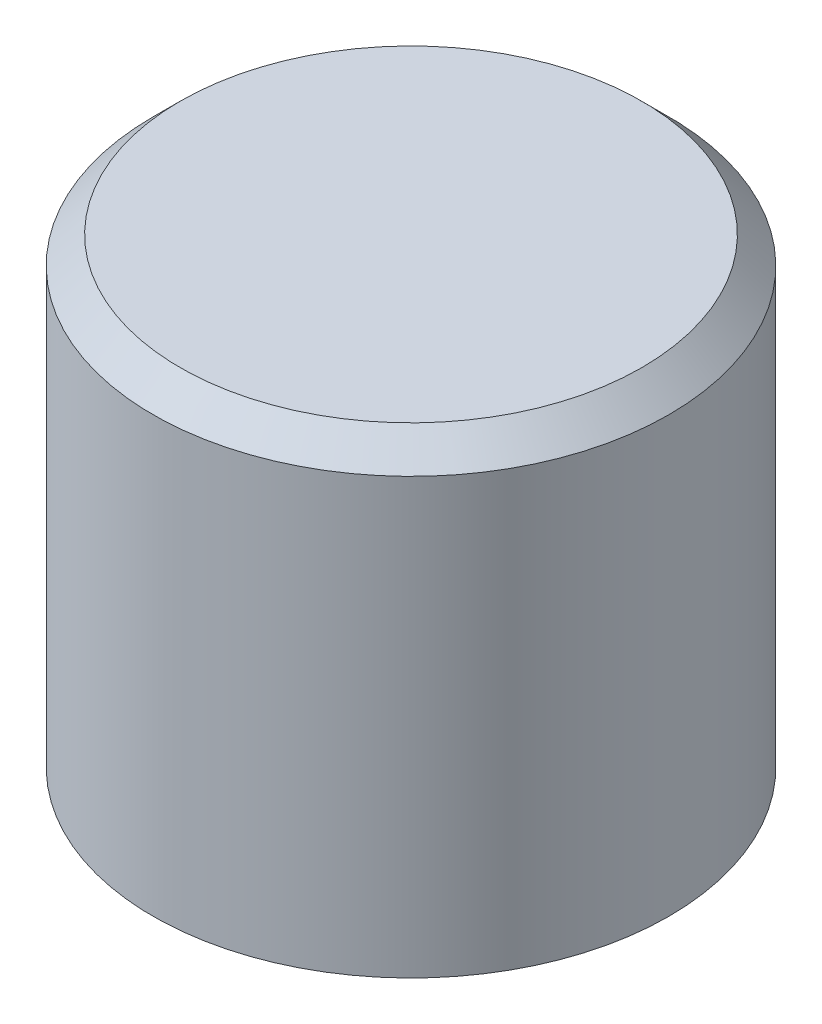
ISO-10303-21;
HEADER;
FILE_DESCRIPTION(('STEP AP214'),'2;1');
FILE_NAME('part.step','',(''),(''),'','','');
FILE_SCHEMA(('AUTOMOTIVE_DESIGN { 1 0 10303 214 1 1 1 1 }'));
ENDSEC;
DATA;
#1=APPLICATION_CONTEXT('core data for automotive mechanical design processes');
#2=APPLICATION_PROTOCOL_DEFINITION('international standard','automotive_design',2000,#1);
#3=PRODUCT_CONTEXT('',#1,'mechanical');
#4=PRODUCT('Part','Part','',(#3));
#5=PRODUCT_RELATED_PRODUCT_CATEGORY('part','',(#4));
#6=PRODUCT_DEFINITION_FORMATION('','',#4);
#7=PRODUCT_DEFINITION_CONTEXT('part definition',#1,'design');
#8=PRODUCT_DEFINITION('design','',#6,#7);
#9=PRODUCT_DEFINITION_SHAPE('','',#8);
#10=(LENGTH_UNIT() NAMED_UNIT(*) SI_UNIT(.MILLI.,.METRE.));
#11=(NAMED_UNIT(*) PLANE_ANGLE_UNIT() SI_UNIT($,.RADIAN.));
#12=(NAMED_UNIT(*) SI_UNIT($,.STERADIAN.) SOLID_ANGLE_UNIT());
#13=UNCERTAINTY_MEASURE_WITH_UNIT(LENGTH_MEASURE(1.E-05),#10,'distance_accuracy_value','');
#14=(GEOMETRIC_REPRESENTATION_CONTEXT(3) GLOBAL_UNCERTAINTY_ASSIGNED_CONTEXT((#13)) GLOBAL_UNIT_ASSIGNED_CONTEXT((#10,
#11,#12)) REPRESENTATION_CONTEXT('',''));
#15=CARTESIAN_POINT('',(0.,0.,0.));
#16=DIRECTION('',(0.,0.,1.));
#17=DIRECTION('',(1.,0.,0.));
#18=AXIS2_PLACEMENT_3D('',#15,#16,#17);
#19=CARTESIAN_POINT('',(0.,8.5,0.));
#20=DIRECTION('',(0.,-1.,0.));
#21=DIRECTION('',(1.,0.,0.));
#22=AXIS2_PLACEMENT_3D('',#19,#20,#21);
#23=PLANE('',#22);
#24=CARTESIAN_POINT('',(0.,8.5,0.));
#25=DIRECTION('',(0.,1.,0.));
#26=DIRECTION('',(-1.,0.,0.));
#27=AXIS2_PLACEMENT_3D('',#24,#25,#26);
#28=CIRCLE('',#27,8.5);
#29=CARTESIAN_POINT('',(-8.50000000000001,8.49999999999999,0.));
#30=VERTEX_POINT('',#29);
#31=EDGE_CURVE('E11',#30,#30,#28,.T.);
#32=ORIENTED_EDGE('',*,*,#31,.T.);
#33=EDGE_LOOP('',(#32));
#34=FACE_BOUND('',#33,.T.);
#35=ADVANCED_FACE('F36',(#34),#23,.F.);
#36=CARTESIAN_POINT('',(0.,7.5,0.));
#37=DIRECTION('',(0.,-1.,0.));
#38=DIRECTION('',(1.,0.,0.));
#39=AXIS2_PLACEMENT_3D('',#36,#37,#38);
#40=CONICAL_SURFACE('',#39,9.5,0.785398163397448);
#41=ORIENTED_EDGE('',*,*,#31,.F.);
#42=EDGE_LOOP('',(#41));
#43=FACE_BOUND('',#42,.T.);
#44=CARTESIAN_POINT('',(0.,7.5,0.));
#45=DIRECTION('',(0.,1.,0.));
#46=DIRECTION('',(-1.,0.,0.));
#47=AXIS2_PLACEMENT_3D('',#44,#45,#46);
#48=CIRCLE('',#47,9.50000000000001);
#49=CARTESIAN_POINT('',(-9.50000000000001,7.5,0.));
#50=VERTEX_POINT('',#49);
#51=EDGE_CURVE('E48',#50,#50,#48,.T.);
#52=ORIENTED_EDGE('',*,*,#51,.T.);
#53=EDGE_LOOP('',(#52));
#54=FACE_BOUND('',#53,.T.);
#55=ADVANCED_FACE('F108',(#43,#54),#40,.T.);
#56=CARTESIAN_POINT('',(0.,8.5,0.));
#57=DIRECTION('',(0.,1.,0.));
#58=DIRECTION('',(-1.,0.,0.));
#59=AXIS2_PLACEMENT_3D('',#56,#57,#58);
#60=CYLINDRICAL_SURFACE('',#59,9.5);
#61=CARTESIAN_POINT('',(1.1303,2.5,-9.43251938296445));
#62=CARTESIAN_POINT('',(1.13029729673654,2.43675209899943,-9.43252025267097));
#63=CARTESIAN_POINT('',(1.12497337602373,2.37346406905431,-9.43316239302475));
#64=CARTESIAN_POINT('',(1.10381839885863,2.24864759113215,-9.43566076196922));
#65=CARTESIAN_POINT('',(1.08797620633137,2.1871210802331,-9.43751827729107));
#66=CARTESIAN_POINT('',(1.04625682246219,2.06765295240496,-9.44223408820014));
#67=CARTESIAN_POINT('',(1.02038625194472,2.00970899944382,-9.44509172337866));
#68=CARTESIAN_POINT('',(0.959358297665038,1.89899641241189,-9.45148499094721));
#69=CARTESIAN_POINT('',(0.924202568260509,1.84622685870116,-9.45502050252777));
#70=CARTESIAN_POINT('',(0.84541065814901,1.74708146620531,-9.46239129242311));
#71=CARTESIAN_POINT('',(0.801736725239775,1.70073572197759,-9.46622785800506));
#72=CARTESIAN_POINT('',(0.707229305333533,1.61601329299469,-9.4737568706389));
#73=CARTESIAN_POINT('',(0.656395469993588,1.57763699619327,-9.47744931066765));
#74=CARTESIAN_POINT('',(0.548823128538747,1.50983574280943,-9.48428711110801));
#75=CARTESIAN_POINT('',(0.492067424631725,1.48043788937346,-9.48743080301658));
#76=CARTESIAN_POINT('',(0.374381126149074,1.43160155810803,-9.49280278116101));
#77=CARTESIAN_POINT('',(0.313450672666535,1.41216274388315,-9.4950310983158));
#78=CARTESIAN_POINT('',(0.189451505363669,1.38388583852823,-9.49831219623447));
#79=CARTESIAN_POINT('',(0.126394322261157,1.37499783547345,-9.49937051019601));
#80=CARTESIAN_POINT('',(-0.000324891536321905,1.36792023011297,-9.5002112351669));
#81=CARTESIAN_POINT('',(-0.0639869004674927,1.36973024429917,-9.49999369191384));
#82=CARTESIAN_POINT('',(-0.189769249176353,1.38395716021668,-9.49831170361627));
#83=CARTESIAN_POINT('',(-0.251895756367292,1.39632038566214,-9.49685356865555));
#84=CARTESIAN_POINT('',(-0.373185838498062,1.43121894501187,-9.49286135812316));
#85=CARTESIAN_POINT('',(-0.432349361612799,1.45375445676905,-9.4903272637394));
#86=CARTESIAN_POINT('',(-0.546201001842327,1.50841542991829,-9.48445703605298));
#87=CARTESIAN_POINT('',(-0.600877796589479,1.54056425637857,-9.48111895255263));
#88=CARTESIAN_POINT('',(-0.704080386813695,1.61352228422025,-9.47401449834974));
#89=CARTESIAN_POINT('',(-0.75260592651891,1.6543318455302,-9.47024810985042));
#90=CARTESIAN_POINT('',(-0.842443645401088,1.74375387032641,-9.46268132531405));
#91=CARTESIAN_POINT('',(-0.883709291599561,1.79241309156265,-9.45888086312078));
#92=CARTESIAN_POINT('',(-0.957494554378539,1.89599217012994,-9.45169735122941));
#93=CARTESIAN_POINT('',(-0.990014147980316,1.95091204390923,-9.448314302628));
#94=CARTESIAN_POINT('',(-1.04538609819267,2.06549342670439,-9.44234862488318));
#95=CARTESIAN_POINT('',(-1.06823495026205,2.12515664535429,-9.43976628599624));
#96=CARTESIAN_POINT('',(-1.10357672108818,2.24751056877989,-9.43570017369646));
#97=CARTESIAN_POINT('',(-1.11607009053464,2.31020114167387,-9.43421635247441));
#98=CARTESIAN_POINT('',(-1.1302850922461,2.43641988715194,-9.43252391667471));
#99=CARTESIAN_POINT('',(-1.13207210966562,2.49994059615691,-9.4323075616881));
#100=CARTESIAN_POINT('',(-1.12499599116383,2.62637626029155,-9.43315409702457));
#101=CARTESIAN_POINT('',(-1.11613306041061,2.68929122706713,-9.43421696270384));
#102=CARTESIAN_POINT('',(-1.08806359469444,2.81253493881977,-9.43749512502887));
#103=CARTESIAN_POINT('',(-1.0688885260964,2.87287095173617,-9.43970691516055));
#104=CARTESIAN_POINT('',(-1.02077141510833,2.98947102807533,-9.4450308731963));
#105=CARTESIAN_POINT('',(-0.991829060265779,3.04573496116355,-9.44814306990364));
#106=CARTESIAN_POINT('',(-0.924837392396674,3.15289015149911,-9.45493577176373));
#107=CARTESIAN_POINT('',(-0.886745083763212,3.20375435770687,-9.45861892998419));
#108=CARTESIAN_POINT('',(-0.802595807924174,3.29839067912928,-9.46613013979121));
#109=CARTESIAN_POINT('',(-0.756538560542182,3.34216254475726,-9.46995819647104));
#110=CARTESIAN_POINT('',(-0.657481685387736,3.42160025323289,-9.47735155346942));
#111=CARTESIAN_POINT('',(-0.604447543020714,3.45722321176042,-9.48091539986245));
#112=CARTESIAN_POINT('',(-0.493110851153499,3.51905559736204,-9.48735720395843));
#113=CARTESIAN_POINT('',(-0.434808399241305,3.54526519876057,-9.49023517436267));
#114=CARTESIAN_POINT('',(-0.314734451794647,3.5874555752365,-9.49497447819186));
#115=CARTESIAN_POINT('',(-0.252971868918825,3.60346142449211,-9.49683830206303));
#116=CARTESIAN_POINT('',(-0.127612324302294,3.62487159189028,-9.49934962268275));
#117=CARTESIAN_POINT('',(-0.0640154372253324,3.63027634092514,-9.49999716886808));
#118=CARTESIAN_POINT('',(0.062788065783669,3.63032335937165,-9.50000279537353));
#119=CARTESIAN_POINT('',(0.125994667091033,3.62503186909515,-9.49936881202669));
#120=CARTESIAN_POINT('',(0.250613675982355,3.60397654630575,-9.49689835171094));
#121=CARTESIAN_POINT('',(0.312026084028317,3.5882127164895,-9.4950618750517));
#122=CARTESIAN_POINT('',(0.43130684317044,3.54668037674206,-9.49039192931731));
#123=CARTESIAN_POINT('',(0.48917620164435,3.52091472601644,-9.48755874519112));
#124=CARTESIAN_POINT('',(0.599780011912009,3.4601170064304,-9.4812096483223));
#125=CARTESIAN_POINT('',(0.652514426051388,3.42508486962616,-9.47769373057379));
#126=CARTESIAN_POINT('',(0.75169020716829,3.34650251162856,-9.47034599616089));
#127=CARTESIAN_POINT('',(0.798092358276887,3.30290295892214,-9.46651242812114));
#128=CARTESIAN_POINT('',(0.882948322582621,3.20852503780183,-9.458975735517));
#129=CARTESIAN_POINT('',(0.92140024488168,3.15774496638415,-9.45527264215831));
#130=CARTESIAN_POINT('',(0.989377750142138,3.05024504723991,-9.4484023311034));
#131=CARTESIAN_POINT('',(1.01887155732429,2.99350499436638,-9.44523703815676));
#132=CARTESIAN_POINT('',(1.06787108902271,2.87587265791908,-9.43982333105209));
#133=CARTESIAN_POINT('',(1.08738778225179,2.8149850180016,-9.43757391055185));
#134=CARTESIAN_POINT('',(1.11115551492696,2.71147848297237,-9.43479836143403));
#135=CARTESIAN_POINT('',(1.11832450861114,2.66951496066416,-9.43394794398313));
#136=CARTESIAN_POINT('',(1.12789764424011,2.58504033792679,-9.43280816420104));
#137=CARTESIAN_POINT('',(1.13030181773216,2.54252924112492,-9.43251879815519));
#138=CARTESIAN_POINT('',(1.1303,2.5,-9.43251938296445));
#139=B_SPLINE_CURVE_WITH_KNOTS('',3,(#61,#62,#63,#64,#65,#66,#67,#68,#69,#70,#71,#72,#73,#74,
#75,#76,#77,#78,#79,#80,#81,#82,#83,#84,#85,#86,#87,#88,#89,#90,#91,#92,#93,#94,#95,#96,#97,#98,
#99,#100,#101,#102,#103,#104,#105,#106,#107,#108,#109,#110,#111,#112,#113,#114,#115,#116,#117,
#118,#119,#120,#121,#122,#123,#124,#125,#126,#127,#128,#129,#130,#131,#132,#133,#134,#135,#136,
#137,#138),.UNSPECIFIED.,.T.,.F.,(4,2,2,2,2,2,2,2,2,2,2,2,2,2,2,2,2,2,2,2,2,2,2,2,2,2,2,2,2,2,2,
2,2,2,2,2,2,2,4),(0.,0.189588352140623,0.379377749093088,0.569042058219121,0.758672597197918,
0.949163491168442,1.13966365608834,1.33073332419121,1.52179653793688,1.7119522550108,
1.90210115532477,2.09128863429427,2.28047942115772,2.47013382446012,2.65979611108984,
2.85063296472298,3.04147031974174,3.23237677245364,3.42327491612799,3.6130060205851,
3.80273346998724,3.99188524461076,4.1810430707159,4.3711077626118,4.56117914162504,
4.75222888541498,4.94327509100321,5.13385000115804,5.32441716504493,5.51380778895664,
5.70319836409987,5.89253483826645,6.08187270072637,6.27233453255905,6.46284161223051,
6.65401676263276,6.84498128304084,6.97246538923302,7.09994865136674),.UNSPECIFIED.);
#140=CARTESIAN_POINT('',(1.1303,2.5,-9.43251938296445));
#141=VERTEX_POINT('',#140);
#142=EDGE_CURVE('E72',#141,#141,#139,.T.);
#143=ORIENTED_EDGE('',*,*,#142,.F.);
#144=EDGE_LOOP('',(#143));
#145=FACE_BOUND('',#144,.T.);
#146=ORIENTED_EDGE('',*,*,#51,.F.);
#147=EDGE_LOOP('',(#146));
#148=FACE_BOUND('',#147,.T.);
#149=CARTESIAN_POINT('',(0.,-8.5,0.));
#150=DIRECTION('',(0.,1.,0.));
#151=DIRECTION('',(-1.,0.,0.));
#152=AXIS2_PLACEMENT_3D('',#149,#150,#151);
#153=CIRCLE('',#152,9.5);
#154=CARTESIAN_POINT('',(-9.5,-8.50000000000001,0.));
#155=VERTEX_POINT('',#154);
#156=EDGE_CURVE('E52',#155,#155,#153,.T.);
#157=ORIENTED_EDGE('',*,*,#156,.T.);
#158=EDGE_LOOP('',(#157));
#159=FACE_BOUND('',#158,.T.);
#160=ADVANCED_FACE('F105',(#145,#148,#159),#60,.T.);
#161=CARTESIAN_POINT('',(9.5,-8.5,0.));
#162=DIRECTION('',(0.,1.,0.));
#163=DIRECTION('',(-1.,0.,0.));
#164=AXIS2_PLACEMENT_3D('',#161,#162,#163);
#165=PLANE('',#164);
#166=ORIENTED_EDGE('',*,*,#156,.F.);
#167=EDGE_LOOP('',(#166));
#168=FACE_BOUND('',#167,.T.);
#169=CARTESIAN_POINT('',(0.,-8.5,0.));
#170=DIRECTION('',(0.,1.,0.));
#171=DIRECTION('',(-1.,0.,0.));
#172=AXIS2_PLACEMENT_3D('',#169,#170,#171);
#173=CIRCLE('',#172,8.5);
#174=CARTESIAN_POINT('',(-8.5,-8.50000000000001,0.));
#175=VERTEX_POINT('',#174);
#176=EDGE_CURVE('E57',#175,#175,#173,.T.);
#177=ORIENTED_EDGE('',*,*,#176,.T.);
#178=EDGE_LOOP('',(#177));
#179=FACE_BOUND('',#178,.T.);
#180=ADVANCED_FACE('F101',(#168,#179),#165,.F.);
#181=CARTESIAN_POINT('',(0.,8.5,0.));
#182=DIRECTION('',(0.,1.,0.));
#183=DIRECTION('',(-1.,0.,0.));
#184=AXIS2_PLACEMENT_3D('',#181,#182,#183);
#185=CYLINDRICAL_SURFACE('',#184,8.5);
#186=ORIENTED_EDGE('',*,*,#176,.F.);
#187=EDGE_LOOP('',(#186));
#188=FACE_BOUND('',#187,.T.);
#189=CARTESIAN_POINT('',(0.,-3.5,0.));
#190=DIRECTION('',(0.,1.,0.));
#191=DIRECTION('',(-1.,0.,0.));
#192=AXIS2_PLACEMENT_3D('',#189,#190,#191);
#193=CIRCLE('',#192,8.5);
#194=CARTESIAN_POINT('',(-8.5,-3.50000000000001,0.));
#195=VERTEX_POINT('',#194);
#196=EDGE_CURVE('E60',#195,#195,#193,.T.);
#197=ORIENTED_EDGE('',*,*,#196,.T.);
#198=EDGE_LOOP('',(#197));
#199=FACE_BOUND('',#198,.T.);
#200=ADVANCED_FACE('F97',(#188,#199),#185,.F.);
#201=CARTESIAN_POINT('',(0.,-0.500000000000002,0.));
#202=DIRECTION('',(0.,-1.,0.));
#203=DIRECTION('',(1.,0.,0.));
#204=AXIS2_PLACEMENT_3D('',#201,#202,#203);
#205=CONICAL_SURFACE('',#204,5.5,0.785398163397448);
#206=ORIENTED_EDGE('',*,*,#196,.F.);
#207=EDGE_LOOP('',(#206));
#208=FACE_BOUND('',#207,.T.);
#209=CARTESIAN_POINT('',(0.,-0.500000000000002,0.));
#210=DIRECTION('',(0.,1.,0.));
#211=DIRECTION('',(-1.,0.,0.));
#212=AXIS2_PLACEMENT_3D('',#209,#210,#211);
#213=CIRCLE('',#212,5.5);
#214=CARTESIAN_POINT('',(-5.5,-0.500000000000004,0.));
#215=VERTEX_POINT('',#214);
#216=EDGE_CURVE('E63',#215,#215,#213,.T.);
#217=ORIENTED_EDGE('',*,*,#216,.T.);
#218=EDGE_LOOP('',(#217));
#219=FACE_BOUND('',#218,.T.);
#220=ADVANCED_FACE('F93',(#208,#219),#205,.F.);
#221=CARTESIAN_POINT('',(5.5,-0.499999999999999,0.));
#222=DIRECTION('',(0.,1.,0.));
#223=DIRECTION('',(-1.,0.,0.));
#224=AXIS2_PLACEMENT_3D('',#221,#222,#223);
#225=PLANE('',#224);
#226=CARTESIAN_POINT('',(0.,-0.500000000000001,0.));
#227=DIRECTION('',(0.,-1.,0.));
#228=DIRECTION('',(1.,0.,0.));
#229=AXIS2_PLACEMENT_3D('',#226,#227,#228);
#230=CIRCLE('',#229,3.175);
#231=CARTESIAN_POINT('',(3.175,-0.5,0.));
#232=VERTEX_POINT('',#231);
#233=EDGE_CURVE('E69',#232,#232,#230,.T.);
#234=ORIENTED_EDGE('',*,*,#233,.F.);
#235=EDGE_LOOP('',(#234));
#236=FACE_BOUND('',#235,.T.);
#237=ORIENTED_EDGE('',*,*,#216,.F.);
#238=EDGE_LOOP('',(#237));
#239=FACE_BOUND('',#238,.T.);
#240=ADVANCED_FACE('F89',(#236,#239),#225,.F.);
#241=CARTESIAN_POINT('',(0.,17.4802561210692,0.));
#242=DIRECTION('',(0.,-1.,0.));
#243=DIRECTION('',(1.,0.,0.));
#244=AXIS2_PLACEMENT_3D('',#241,#242,#243);
#245=CYLINDRICAL_SURFACE('',#244,3.175);
#246=CARTESIAN_POINT('',(1.1303,2.5,-2.96699290696827));
#247=CARTESIAN_POINT('',(1.13030126949561,2.43871104066149,-2.96699180092178));
#248=CARTESIAN_POINT('',(1.12529831217773,2.37743087265426,-2.96891266523162));
#249=CARTESIAN_POINT('',(1.10549852105486,2.2567032380783,-2.976341367105));
#250=CARTESIAN_POINT('',(1.09070115134954,2.19725587197743,-2.9818494009399));
#251=CARTESIAN_POINT('',(1.05191211633808,2.08196624751789,-2.99575115501929));
#252=CARTESIAN_POINT('',(1.02794056093624,2.02611641398142,-3.00413855954278));
#253=CARTESIAN_POINT('',(0.971553767874789,1.91921075037205,-3.02284430324832));
#254=CARTESIAN_POINT('',(0.939136285382001,1.86815619974747,-3.03316315558202));
#255=CARTESIAN_POINT('',(0.865225378101704,1.77000779314337,-3.05508626986901));
#256=CARTESIAN_POINT('',(0.823416737479138,1.72315910938416,-3.06672572194972));
#257=CARTESIAN_POINT('',(0.732580946565029,1.63696785663703,-3.08968323184445));
#258=CARTESIAN_POINT('',(0.683552447130751,1.59762669370735,-3.1010012291171));
#259=CARTESIAN_POINT('',(0.577839731348625,1.52641872000411,-3.1224537652803));
#260=CARTESIAN_POINT('',(0.520968849300918,1.49481389119784,-3.13254217002369));
#261=CARTESIAN_POINT('',(0.402295832054575,1.44171944070599,-3.14997980235623));
#262=CARTESIAN_POINT('',(0.340495233260628,1.42022668176793,-3.15732987935941));
#263=CARTESIAN_POINT('',(0.216291429363959,1.38881290011866,-3.16821317131574));
#264=CARTESIAN_POINT('',(0.154007098319547,1.37847077218956,-3.17188488321263));
#265=CARTESIAN_POINT('',(0.0284859904407207,1.36830739361332,-3.1754922345549));
#266=CARTESIAN_POINT('',(-0.0347505016117886,1.36848305732182,-3.17542896974461));
#267=CARTESIAN_POINT('',(-0.157380355815446,1.37909474254008,-3.17166431166137));
#268=CARTESIAN_POINT('',(-0.216819232200467,1.38907222153224,-3.16812551082658));
#269=CARTESIAN_POINT('',(-0.333116055100486,1.41823912297426,-3.15801637664471));
#270=CARTESIAN_POINT('',(-0.389973821301095,1.4374291879277,-3.15144583185916));
#271=CARTESIAN_POINT('',(-0.500434290449896,1.48471458900652,-3.13581701279072));
#272=CARTESIAN_POINT('',(-0.553980350398553,1.5129307133355,-3.12672523235359));
#273=CARTESIAN_POINT('',(-0.655704901634495,1.57736408624447,-3.10698647045265));
#274=CARTESIAN_POINT('',(-0.703881757104614,1.61358376326904,-3.09633901729824));
#275=CARTESIAN_POINT('',(-0.796215706775618,1.69525388606659,-3.07392952110035));
#276=CARTESIAN_POINT('',(-0.840022503287889,1.74109295380745,-3.06213831691244));
#277=CARTESIAN_POINT('',(-0.919450536225369,1.83955262127153,-3.03923485845035));
#278=CARTESIAN_POINT('',(-0.955070114455716,1.89217459140461,-3.02812274204891));
#279=CARTESIAN_POINT('',(-1.01769271316585,2.00395927014954,-3.00766281876103));
#280=CARTESIAN_POINT('',(-1.04452651167638,2.06322387032357,-2.99835093480064));
#281=CARTESIAN_POINT('',(-1.08770687791103,2.18584794602894,-2.98296002370199));
#282=CARTESIAN_POINT('',(-1.10405859416822,2.24920539439739,-2.97687940969725));
#283=CARTESIAN_POINT('',(-1.12505332850273,2.37478496139067,-2.96900658684162));
#284=CARTESIAN_POINT('',(-1.13024679297079,2.43690238719621,-2.96701300712206));
#285=CARTESIAN_POINT('',(-1.13035235934412,2.5611397141368,-2.96697312971029));
#286=CARTESIAN_POINT('',(-1.12526668272106,2.62325961183634,-2.9689259791374));
#287=CARTESIAN_POINT('',(-1.10545550475944,2.74306963694744,-2.97635611028255));
#288=CARTESIAN_POINT('',(-1.0911347174114,2.80083689931116,-2.98168526601896));
#289=CARTESIAN_POINT('',(-1.05375787852425,2.91312956528054,-2.99509779472348));
#290=CARTESIAN_POINT('',(-1.03070014678855,2.96765434299104,-3.00318169742523));
#291=CARTESIAN_POINT('',(-0.975593219400547,3.07402870077888,-3.0215413409512));
#292=CARTESIAN_POINT('',(-0.943258091531735,3.12571831619922,-3.03188377797999));
#293=CARTESIAN_POINT('',(-0.870827536052561,3.22313515891388,-3.0534751542732));
#294=CARTESIAN_POINT('',(-0.830729519593916,3.26886038860491,-3.0647243952155));
#295=CARTESIAN_POINT('',(-0.741245393025423,3.35570682630943,-3.0876248127599));
#296=CARTESIAN_POINT('',(-0.691464443347563,3.39642589385312,-3.09926313882806));
#297=CARTESIAN_POINT('',(-0.585488794794463,3.4689702537958,-3.12101743586169));
#298=CARTESIAN_POINT('',(-0.529294210180944,3.50079570460365,-3.13113343394065));
#299=CARTESIAN_POINT('',(-0.412253306959744,3.55439303737067,-3.14867455762266));
#300=CARTESIAN_POINT('',(-0.351432796366107,3.57621652202379,-3.15611345134428));
#301=CARTESIAN_POINT('',(-0.226662836118679,3.60921657077384,-3.16751726579441));
#302=CARTESIAN_POINT('',(-0.162714706431159,3.62039758629356,-3.17148363891749));
#303=CARTESIAN_POINT('',(-0.0371588940228263,3.63135162680515,-3.17537085125336));
#304=CARTESIAN_POINT('',(0.0243929105435869,3.63169853870223,-3.17549520012136));
#305=CARTESIAN_POINT('',(0.146637730412363,3.62242232763044,-3.1722011158763));
#306=CARTESIAN_POINT('',(0.207330832009701,3.61280021381262,-3.16878304135799));
#307=CARTESIAN_POINT('',(0.324899902225857,3.58425332312023,-3.1588730580352));
#308=CARTESIAN_POINT('',(0.381828226370772,3.56552049032344,-3.15244466988758));
#309=CARTESIAN_POINT('',(0.491747356923696,3.51946825328886,-3.13717898355161));
#310=CARTESIAN_POINT('',(0.544737424039252,3.49214724188061,-3.12834123452256));
#311=CARTESIAN_POINT('',(0.647587160628671,3.4284464342489,-3.10871467602532));
#312=CARTESIAN_POINT('',(0.69723748981861,3.39174861614924,-3.09786207604759));
#313=CARTESIAN_POINT('',(0.789857808823599,3.31085525273558,-3.07555250387425));
#314=CARTESIAN_POINT('',(0.832825512939461,3.26665715281576,-3.06409532667805));
#315=CARTESIAN_POINT('',(0.912898108309838,3.16957728604716,-3.04122635424545));
#316=CARTESIAN_POINT('',(0.949639270596971,3.11638813255844,-3.0298412400875));
#317=CARTESIAN_POINT('',(1.01365584279662,3.00422984781983,-3.00903053343651));
#318=CARTESIAN_POINT('',(1.04093198735494,2.94526116561516,-2.99960478888595));
#319=CARTESIAN_POINT('',(1.08510912643682,2.82302364224739,-2.9839099977344));
#320=CARTESIAN_POINT('',(1.10199264087853,2.75974775389295,-2.97764627271748));
#321=CARTESIAN_POINT('',(1.12458464442987,2.63097715823261,-2.96918932171508));
#322=CARTESIAN_POINT('',(1.13029864362041,2.56548356118473,-2.96699408871232));
#323=CARTESIAN_POINT('',(1.1303,2.5,-2.96699290696827));
#324=B_SPLINE_CURVE_WITH_KNOTS('',3,(#246,#247,#248,#249,#250,#251,#252,#253,#254,#255,#256,
#257,#258,#259,#260,#261,#262,#263,#264,#265,#266,#267,#268,#269,#270,#271,#272,#273,#274,#275,
#276,#277,#278,#279,#280,#281,#282,#283,#284,#285,#286,#287,#288,#289,#290,#291,#292,#293,#294,
#295,#296,#297,#298,#299,#300,#301,#302,#303,#304,#305,#306,#307,#308,#309,#310,#311,#312,#313,
#314,#315,#316,#317,#318,#319,#320,#321,#322,#323),.UNSPECIFIED.,.T.,.F.,(4,2,2,2,2,2,2,2,2,2,2,
2,2,2,2,2,2,2,2,2,2,2,2,2,2,2,2,2,2,2,2,2,2,2,2,2,2,2,4),(0.,0.18362366178485,0.367257371351087,
0.55049083842956,0.733773056690744,0.924501319590958,1.11526526836209,1.3117975652931,
1.50826884814033,1.69702812609223,1.88573202729147,2.06600906280416,2.24629867301317,
2.42910965891793,2.61197618983504,2.80457310610201,2.99720899560137,3.19336255385327,
3.38941969247878,3.57555921531926,3.76165851500699,3.94011049494313,4.11859681030486,
4.30331748902537,4.48809987675376,4.68324756844095,4.87839178402888,5.07251754238689,
5.2665620680873,5.45030949868025,5.63403833058547,5.81405386702816,5.99410311120744,
6.18133819670187,6.36863718318313,6.56461137244542,6.76057034738462,6.95685802501451,
7.15304884667686),.UNSPECIFIED.);
#325=CARTESIAN_POINT('',(1.1303,2.5,-2.96699290696827));
#326=VERTEX_POINT('',#325);
#327=EDGE_CURVE('E39',#326,#326,#324,.T.);
#328=ORIENTED_EDGE('',*,*,#327,.T.);
#329=EDGE_LOOP('',(#328));
#330=FACE_BOUND('',#329,.T.);
#331=CARTESIAN_POINT('',(0.,6.5,0.));
#332=DIRECTION('',(0.,-1.,0.));
#333=DIRECTION('',(1.,0.,0.));
#334=AXIS2_PLACEMENT_3D('',#331,#332,#333);
#335=CIRCLE('',#334,3.175);
#336=CARTESIAN_POINT('',(3.175,6.5,0.));
#337=VERTEX_POINT('',#336);
#338=EDGE_CURVE('E66',#337,#337,#335,.F.);
#339=ORIENTED_EDGE('',*,*,#338,.T.);
#340=EDGE_LOOP('',(#339));
#341=FACE_BOUND('',#340,.T.);
#342=ORIENTED_EDGE('',*,*,#233,.T.);
#343=EDGE_LOOP('',(#342));
#344=FACE_BOUND('',#343,.T.);
#345=ADVANCED_FACE('F84',(#330,#341,#344),#245,.F.);
#346=CARTESIAN_POINT('',(0.,6.5,0.));
#347=DIRECTION('',(0.,-1.,0.));
#348=DIRECTION('',(1.,0.,0.));
#349=AXIS2_PLACEMENT_3D('',#346,#347,#348);
#350=PLANE('',#349);
#351=ORIENTED_EDGE('',*,*,#338,.F.);
#352=EDGE_LOOP('',(#351));
#353=FACE_BOUND('',#352,.T.);
#354=ADVANCED_FACE('F82',(#353),#350,.T.);
#355=CARTESIAN_POINT('',(0.,2.5,-9.501));
#356=DIRECTION('',(0.,0.,1.));
#357=DIRECTION('',(1.,0.,0.));
#358=AXIS2_PLACEMENT_3D('',#355,#356,#357);
#359=CYLINDRICAL_SURFACE('',#358,1.1303);
#360=ORIENTED_EDGE('',*,*,#142,.T.);
#361=EDGE_LOOP('',(#360));
#362=FACE_BOUND('',#361,.T.);
#363=ORIENTED_EDGE('',*,*,#327,.F.);
#364=EDGE_LOOP('',(#363));
#365=FACE_BOUND('',#364,.T.);
#366=ADVANCED_FACE('F78',(#362,#365),#359,.F.);
#367=CLOSED_SHELL('',(#35,#55,#160,#180,#200,#220,#240,#345,#354,#366));
#368=MANIFOLD_SOLID_BREP('B2',#367);
#369=ADVANCED_BREP_SHAPE_REPRESENTATION('',(#18,#368),#14);
#370=SHAPE_DEFINITION_REPRESENTATION(#9,#369);
ENDSEC;
END-ISO-10303-21;
